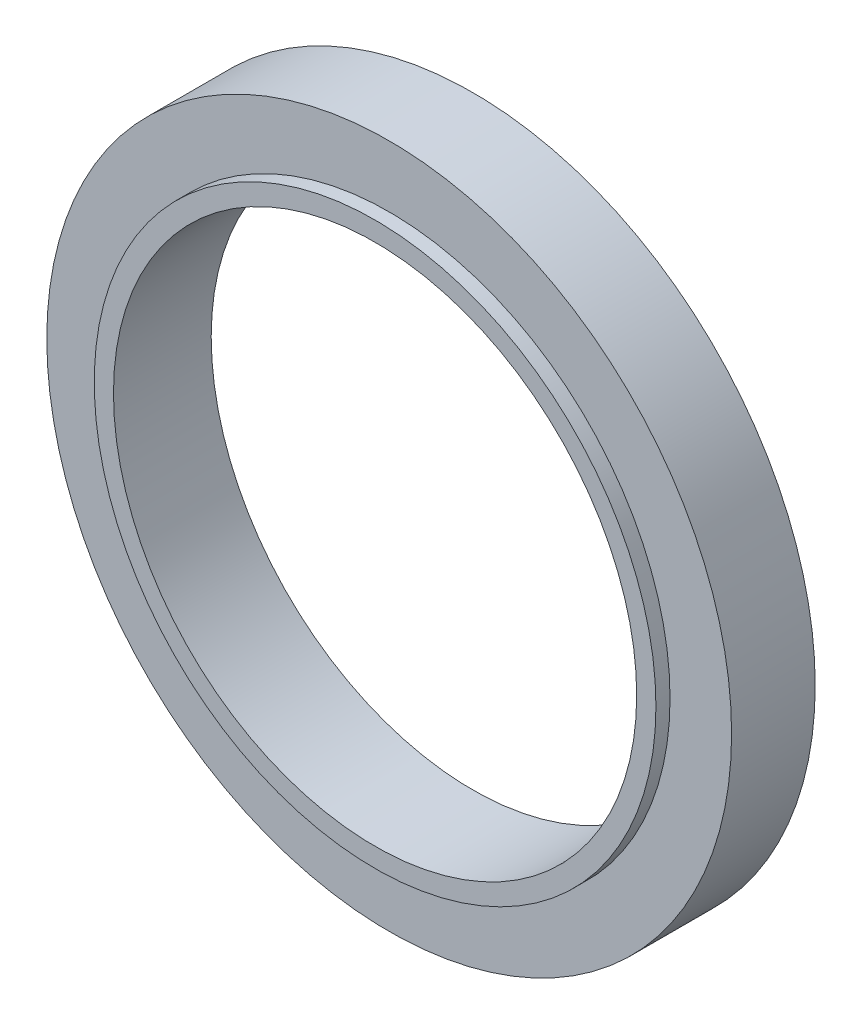
ISO-10303-21;
HEADER;
FILE_DESCRIPTION(('STEP AP214'),'2;1');
FILE_NAME('part.step','',(''),(''),'','','');
FILE_SCHEMA(('AUTOMOTIVE_DESIGN { 1 0 10303 214 1 1 1 1 }'));
ENDSEC;
DATA;
#1=APPLICATION_CONTEXT('core data for automotive mechanical design processes');
#2=APPLICATION_PROTOCOL_DEFINITION('international standard','automotive_design',2000,#1);
#3=PRODUCT_CONTEXT('',#1,'mechanical');
#4=PRODUCT('Part','Part','',(#3));
#5=PRODUCT_RELATED_PRODUCT_CATEGORY('part','',(#4));
#6=PRODUCT_DEFINITION_FORMATION('','',#4);
#7=PRODUCT_DEFINITION_CONTEXT('part definition',#1,'design');
#8=PRODUCT_DEFINITION('design','',#6,#7);
#9=PRODUCT_DEFINITION_SHAPE('','',#8);
#10=(LENGTH_UNIT() NAMED_UNIT(*) SI_UNIT(.MILLI.,.METRE.));
#11=(NAMED_UNIT(*) PLANE_ANGLE_UNIT() SI_UNIT($,.RADIAN.));
#12=(NAMED_UNIT(*) SI_UNIT($,.STERADIAN.) SOLID_ANGLE_UNIT());
#13=UNCERTAINTY_MEASURE_WITH_UNIT(LENGTH_MEASURE(1.E-05),#10,'distance_accuracy_value','');
#14=(GEOMETRIC_REPRESENTATION_CONTEXT(3) GLOBAL_UNCERTAINTY_ASSIGNED_CONTEXT((#13)) GLOBAL_UNIT_ASSIGNED_CONTEXT((#10,
#11,#12)) REPRESENTATION_CONTEXT('',''));
#15=CARTESIAN_POINT('',(0.,0.,0.));
#16=DIRECTION('',(0.,0.,1.));
#17=DIRECTION('',(1.,0.,0.));
#18=AXIS2_PLACEMENT_3D('',#15,#16,#17);
#19=CARTESIAN_POINT('',(0.,0.,38.1));
#20=DIRECTION('',(0.,0.,1.));
#21=DIRECTION('',(1.,0.,0.));
#22=AXIS2_PLACEMENT_3D('',#19,#20,#21);
#23=PLANE('',#22);
#24=CARTESIAN_POINT('',(0.,0.,38.1));
#25=DIRECTION('',(0.,0.,1.));
#26=DIRECTION('',(1.,0.,0.));
#27=AXIS2_PLACEMENT_3D('',#24,#25,#26);
#28=CIRCLE('',#27,109.5);
#29=CARTESIAN_POINT('',(109.5,0.,38.1));
#30=VERTEX_POINT('',#29);
#31=EDGE_CURVE('E11',#30,#30,#28,.T.);
#32=ORIENTED_EDGE('',*,*,#31,.T.);
#33=EDGE_LOOP('',(#32));
#34=FACE_BOUND('',#33,.T.);
#35=CARTESIAN_POINT('',(0.,0.,38.1));
#36=DIRECTION('',(0.,0.,1.));
#37=DIRECTION('',(1.,0.,0.));
#38=AXIS2_PLACEMENT_3D('',#35,#36,#37);
#39=CIRCLE('',#38,102.);
#40=CARTESIAN_POINT('',(102.,0.,38.1));
#41=VERTEX_POINT('',#40);
#42=EDGE_CURVE('E51',#41,#41,#39,.T.);
#43=ORIENTED_EDGE('',*,*,#42,.F.);
#44=EDGE_LOOP('',(#43));
#45=FACE_BOUND('',#44,.T.);
#46=ADVANCED_FACE('F44',(#34,#45),#23,.T.);
#47=CARTESIAN_POINT('',(0.,0.,0.));
#48=DIRECTION('',(0.,0.,1.));
#49=DIRECTION('',(1.,0.,0.));
#50=AXIS2_PLACEMENT_3D('',#47,#48,#49);
#51=PLANE('',#50);
#52=CARTESIAN_POINT('',(0.,0.,0.));
#53=DIRECTION('',(0.,0.,1.));
#54=DIRECTION('',(1.,0.,0.));
#55=AXIS2_PLACEMENT_3D('',#52,#53,#54);
#56=CIRCLE('',#55,102.);
#57=CARTESIAN_POINT('',(102.,0.,0.));
#58=VERTEX_POINT('',#57);
#59=EDGE_CURVE('E55',#58,#58,#56,.T.);
#60=ORIENTED_EDGE('',*,*,#59,.T.);
#61=EDGE_LOOP('',(#60));
#62=FACE_BOUND('',#61,.T.);
#63=CARTESIAN_POINT('',(0.,0.,0.));
#64=DIRECTION('',(0.,0.,1.));
#65=DIRECTION('',(1.,0.,0.));
#66=AXIS2_PLACEMENT_3D('',#63,#64,#65);
#67=CIRCLE('',#66,133.5);
#68=CARTESIAN_POINT('',(133.5,0.,0.));
#69=VERTEX_POINT('',#68);
#70=EDGE_CURVE('E62',#69,#69,#67,.T.);
#71=ORIENTED_EDGE('',*,*,#70,.F.);
#72=EDGE_LOOP('',(#71));
#73=FACE_BOUND('',#72,.T.);
#74=ADVANCED_FACE('F87',(#62,#73),#51,.F.);
#75=CARTESIAN_POINT('',(0.,0.,38.1));
#76=DIRECTION('',(0.,0.,-1.));
#77=DIRECTION('',(-1.,0.,0.));
#78=AXIS2_PLACEMENT_3D('',#75,#76,#77);
#79=CYLINDRICAL_SURFACE('',#78,109.5);
#80=CARTESIAN_POINT('',(0.,0.,32.6));
#81=DIRECTION('',(0.,0.,1.));
#82=DIRECTION('',(1.,0.,0.));
#83=AXIS2_PLACEMENT_3D('',#80,#81,#82);
#84=CIRCLE('',#83,109.5);
#85=CARTESIAN_POINT('',(109.5,0.,32.6));
#86=VERTEX_POINT('',#85);
#87=EDGE_CURVE('E65',#86,#86,#84,.T.);
#88=ORIENTED_EDGE('',*,*,#87,.T.);
#89=EDGE_LOOP('',(#88));
#90=FACE_BOUND('',#89,.T.);
#91=ORIENTED_EDGE('',*,*,#31,.F.);
#92=EDGE_LOOP('',(#91));
#93=FACE_BOUND('',#92,.T.);
#94=ADVANCED_FACE('F46',(#90,#93),#79,.T.);
#95=CARTESIAN_POINT('',(0.,0.,38.1));
#96=DIRECTION('',(0.,0.,-1.));
#97=DIRECTION('',(-1.,0.,0.));
#98=AXIS2_PLACEMENT_3D('',#95,#96,#97);
#99=CYLINDRICAL_SURFACE('',#98,102.);
#100=ORIENTED_EDGE('',*,*,#42,.T.);
#101=EDGE_LOOP('',(#100));
#102=FACE_BOUND('',#101,.T.);
#103=ORIENTED_EDGE('',*,*,#59,.F.);
#104=EDGE_LOOP('',(#103));
#105=FACE_BOUND('',#104,.T.);
#106=ADVANCED_FACE('F76',(#102,#105),#99,.F.);
#107=CARTESIAN_POINT('',(0.,0.,32.6));
#108=DIRECTION('',(0.,0.,1.));
#109=DIRECTION('',(1.,0.,0.));
#110=AXIS2_PLACEMENT_3D('',#107,#108,#109);
#111=PLANE('',#110);
#112=CARTESIAN_POINT('',(0.,0.,32.6));
#113=DIRECTION('',(0.,0.,1.));
#114=DIRECTION('',(1.,0.,0.));
#115=AXIS2_PLACEMENT_3D('',#112,#113,#114);
#116=CIRCLE('',#115,133.5);
#117=CARTESIAN_POINT('',(133.5,0.,32.6));
#118=VERTEX_POINT('',#117);
#119=EDGE_CURVE('E60',#118,#118,#116,.T.);
#120=ORIENTED_EDGE('',*,*,#119,.T.);
#121=EDGE_LOOP('',(#120));
#122=FACE_BOUND('',#121,.T.);
#123=ORIENTED_EDGE('',*,*,#87,.F.);
#124=EDGE_LOOP('',(#123));
#125=FACE_BOUND('',#124,.T.);
#126=ADVANCED_FACE('F73',(#122,#125),#111,.T.);
#127=CARTESIAN_POINT('',(0.,0.,32.6));
#128=DIRECTION('',(0.,0.,-1.));
#129=DIRECTION('',(-1.,0.,0.));
#130=AXIS2_PLACEMENT_3D('',#127,#128,#129);
#131=CYLINDRICAL_SURFACE('',#130,133.5);
#132=ORIENTED_EDGE('',*,*,#119,.F.);
#133=EDGE_LOOP('',(#132));
#134=FACE_BOUND('',#133,.T.);
#135=ORIENTED_EDGE('',*,*,#70,.T.);
#136=EDGE_LOOP('',(#135));
#137=FACE_BOUND('',#136,.T.);
#138=ADVANCED_FACE('F75',(#134,#137),#131,.T.);
#139=CLOSED_SHELL('',(#46,#74,#94,#106,#126,#138));
#140=MANIFOLD_SOLID_BREP('B2',#139);
#141=ADVANCED_BREP_SHAPE_REPRESENTATION('',(#18,#140),#14);
#142=SHAPE_DEFINITION_REPRESENTATION(#9,#141);
ENDSEC;
END-ISO-10303-21;
